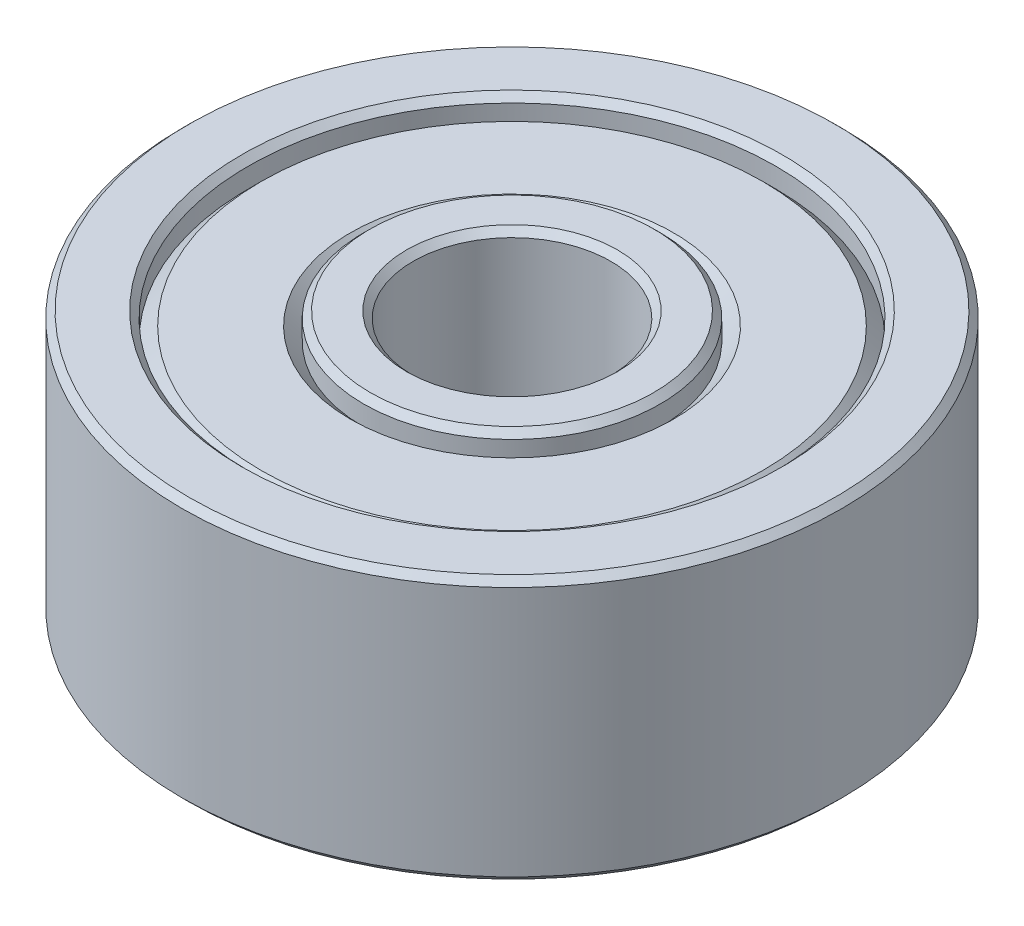
ISO-10303-21;
HEADER;
FILE_DESCRIPTION(('STEP AP214'),'2;1');
FILE_NAME('part.step','',(''),(''),'','','');
FILE_SCHEMA(('AUTOMOTIVE_DESIGN { 1 0 10303 214 1 1 1 1 }'));
ENDSEC;
DATA;
#1=APPLICATION_CONTEXT('core data for automotive mechanical design processes');
#2=APPLICATION_PROTOCOL_DEFINITION('international standard','automotive_design',2000,#1);
#3=PRODUCT_CONTEXT('',#1,'mechanical');
#4=PRODUCT('Part','Part','',(#3));
#5=PRODUCT_RELATED_PRODUCT_CATEGORY('part','',(#4));
#6=PRODUCT_DEFINITION_FORMATION('','',#4);
#7=PRODUCT_DEFINITION_CONTEXT('part definition',#1,'design');
#8=PRODUCT_DEFINITION('design','',#6,#7);
#9=PRODUCT_DEFINITION_SHAPE('','',#8);
#10=(LENGTH_UNIT() NAMED_UNIT(*) SI_UNIT(.MILLI.,.METRE.));
#11=(NAMED_UNIT(*) PLANE_ANGLE_UNIT() SI_UNIT($,.RADIAN.));
#12=(NAMED_UNIT(*) SI_UNIT($,.STERADIAN.) SOLID_ANGLE_UNIT());
#13=UNCERTAINTY_MEASURE_WITH_UNIT(LENGTH_MEASURE(1.E-05),#10,'distance_accuracy_value','');
#14=(GEOMETRIC_REPRESENTATION_CONTEXT(3) GLOBAL_UNCERTAINTY_ASSIGNED_CONTEXT((#13)) GLOBAL_UNIT_ASSIGNED_CONTEXT((#10,
#11,#12)) REPRESENTATION_CONTEXT('',''));
#15=CARTESIAN_POINT('',(0.,0.,0.));
#16=DIRECTION('',(0.,0.,1.));
#17=DIRECTION('',(1.,0.,0.));
#18=AXIS2_PLACEMENT_3D('',#15,#16,#17);
#19=CARTESIAN_POINT('',(0.,-2.,0.));
#20=DIRECTION('',(0.,1.,0.));
#21=DIRECTION('',(0.,0.,1.));
#22=AXIS2_PLACEMENT_3D('',#19,#20,#21);
#23=PLANE('',#22);
#24=CARTESIAN_POINT('',(0.,-2.,0.));
#25=DIRECTION('',(0.,1.,0.));
#26=DIRECTION('',(0.,0.,1.));
#27=AXIS2_PLACEMENT_3D('',#24,#25,#26);
#28=CIRCLE('',#27,4.10000000000001);
#29=CARTESIAN_POINT('',(0.,-2.,4.10000000000001));
#30=VERTEX_POINT('',#29);
#31=EDGE_CURVE('E62',#30,#30,#28,.T.);
#32=ORIENTED_EDGE('',*,*,#31,.T.);
#33=EDGE_LOOP('',(#32));
#34=FACE_BOUND('',#33,.T.);
#35=CARTESIAN_POINT('',(0.,-2.,0.));
#36=DIRECTION('',(0.,1.,0.));
#37=DIRECTION('',(0.,0.,1.));
#38=AXIS2_PLACEMENT_3D('',#35,#36,#37);
#39=CIRCLE('',#38,4.9);
#40=CARTESIAN_POINT('',(0.,-2.,4.9));
#41=VERTEX_POINT('',#40);
#42=EDGE_CURVE('E65',#41,#41,#39,.F.);
#43=ORIENTED_EDGE('',*,*,#42,.T.);
#44=EDGE_LOOP('',(#43));
#45=FACE_BOUND('',#44,.T.);
#46=ADVANCED_FACE('F36',(#34,#45),#23,.F.);
#47=CARTESIAN_POINT('',(0.,-2.,0.));
#48=DIRECTION('',(0.,1.,0.));
#49=DIRECTION('',(0.,0.,1.));
#50=AXIS2_PLACEMENT_3D('',#47,#48,#49);
#51=CIRCLE('',#50,1.6);
#52=CARTESIAN_POINT('',(0.,-2.,1.6));
#53=VERTEX_POINT('',#52);
#54=EDGE_CURVE('E86',#53,#53,#51,.T.);
#55=ORIENTED_EDGE('',*,*,#54,.T.);
#56=EDGE_LOOP('',(#55));
#57=FACE_BOUND('',#56,.T.);
#58=CARTESIAN_POINT('',(0.,-2.,0.));
#59=DIRECTION('',(0.,1.,0.));
#60=DIRECTION('',(0.,0.,1.));
#61=AXIS2_PLACEMENT_3D('',#58,#59,#60);
#62=CIRCLE('',#61,2.15);
#63=CARTESIAN_POINT('',(0.,-2.,2.15));
#64=VERTEX_POINT('',#63);
#65=EDGE_CURVE('E89',#64,#64,#62,.F.);
#66=ORIENTED_EDGE('',*,*,#65,.T.);
#67=EDGE_LOOP('',(#66));
#68=FACE_BOUND('',#67,.T.);
#69=ADVANCED_FACE('F143',(#57,#68),#23,.F.);
#70=CARTESIAN_POINT('',(0.,2.,0.));
#71=DIRECTION('',(0.,1.,0.));
#72=DIRECTION('',(0.,0.,1.));
#73=AXIS2_PLACEMENT_3D('',#70,#71,#72);
#74=PLANE('',#73);
#75=CARTESIAN_POINT('',(0.,2.,0.));
#76=DIRECTION('',(0.,1.,0.));
#77=DIRECTION('',(0.,0.,1.));
#78=AXIS2_PLACEMENT_3D('',#75,#76,#77);
#79=CIRCLE('',#78,4.1);
#80=CARTESIAN_POINT('',(0.,2.,4.1));
#81=VERTEX_POINT('',#80);
#82=EDGE_CURVE('E47',#81,#81,#79,.F.);
#83=ORIENTED_EDGE('',*,*,#82,.T.);
#84=EDGE_LOOP('',(#83));
#85=FACE_BOUND('',#84,.T.);
#86=CARTESIAN_POINT('',(0.,2.,0.));
#87=DIRECTION('',(0.,1.,0.));
#88=DIRECTION('',(0.,0.,1.));
#89=AXIS2_PLACEMENT_3D('',#86,#87,#88);
#90=CIRCLE('',#89,4.9);
#91=CARTESIAN_POINT('',(0.,2.,4.9));
#92=VERTEX_POINT('',#91);
#93=EDGE_CURVE('E51',#92,#92,#90,.T.);
#94=ORIENTED_EDGE('',*,*,#93,.T.);
#95=EDGE_LOOP('',(#94));
#96=FACE_BOUND('',#95,.T.);
#97=ADVANCED_FACE('F149',(#85,#96),#74,.T.);
#98=CARTESIAN_POINT('',(0.,2.,0.));
#99=DIRECTION('',(0.,1.,0.));
#100=DIRECTION('',(0.,0.,1.));
#101=AXIS2_PLACEMENT_3D('',#98,#99,#100);
#102=CIRCLE('',#101,1.6);
#103=CARTESIAN_POINT('',(0.,2.,1.6));
#104=VERTEX_POINT('',#103);
#105=EDGE_CURVE('E74',#104,#104,#102,.F.);
#106=ORIENTED_EDGE('',*,*,#105,.T.);
#107=EDGE_LOOP('',(#106));
#108=FACE_BOUND('',#107,.T.);
#109=CARTESIAN_POINT('',(0.,2.,0.));
#110=DIRECTION('',(0.,1.,0.));
#111=DIRECTION('',(0.,0.,1.));
#112=AXIS2_PLACEMENT_3D('',#109,#110,#111);
#113=CIRCLE('',#112,2.15);
#114=CARTESIAN_POINT('',(0.,2.,2.15));
#115=VERTEX_POINT('',#114);
#116=EDGE_CURVE('E77',#115,#115,#113,.T.);
#117=ORIENTED_EDGE('',*,*,#116,.T.);
#118=EDGE_LOOP('',(#117));
#119=FACE_BOUND('',#118,.T.);
#120=ADVANCED_FACE('F159',(#108,#119),#74,.T.);
#121=CARTESIAN_POINT('',(0.,2.,0.));
#122=DIRECTION('',(0.,1.,0.));
#123=DIRECTION('',(0.,0.,1.));
#124=AXIS2_PLACEMENT_3D('',#121,#122,#123);
#125=CYLINDRICAL_SURFACE('',#124,1.5);
#126=CARTESIAN_POINT('',(0.,-1.9,0.));
#127=DIRECTION('',(0.,1.,0.));
#128=DIRECTION('',(0.,0.,1.));
#129=AXIS2_PLACEMENT_3D('',#126,#127,#128);
#130=CIRCLE('',#129,1.5);
#131=CARTESIAN_POINT('',(0.,-1.9,1.5));
#132=VERTEX_POINT('',#131);
#133=EDGE_CURVE('E80',#132,#132,#130,.F.);
#134=ORIENTED_EDGE('',*,*,#133,.T.);
#135=EDGE_LOOP('',(#134));
#136=FACE_BOUND('',#135,.T.);
#137=CARTESIAN_POINT('',(0.,1.9,0.));
#138=DIRECTION('',(0.,1.,0.));
#139=DIRECTION('',(0.,0.,1.));
#140=AXIS2_PLACEMENT_3D('',#137,#138,#139);
#141=CIRCLE('',#140,1.5);
#142=CARTESIAN_POINT('',(0.,1.9,1.5));
#143=VERTEX_POINT('',#142);
#144=EDGE_CURVE('E83',#143,#143,#141,.T.);
#145=ORIENTED_EDGE('',*,*,#144,.T.);
#146=EDGE_LOOP('',(#145));
#147=FACE_BOUND('',#146,.T.);
#148=ADVANCED_FACE('F156',(#136,#147),#125,.F.);
#149=CARTESIAN_POINT('',(0.,2.,0.));
#150=DIRECTION('',(0.,1.,0.));
#151=DIRECTION('',(0.,0.,1.));
#152=AXIS2_PLACEMENT_3D('',#149,#150,#151);
#153=CYLINDRICAL_SURFACE('',#152,5.);
#154=CARTESIAN_POINT('',(0.,-1.9,0.));
#155=DIRECTION('',(0.,1.,0.));
#156=DIRECTION('',(0.,0.,1.));
#157=AXIS2_PLACEMENT_3D('',#154,#155,#156);
#158=CIRCLE('',#157,5.);
#159=CARTESIAN_POINT('',(0.,-1.9,5.));
#160=VERTEX_POINT('',#159);
#161=EDGE_CURVE('E10',#160,#160,#158,.T.);
#162=ORIENTED_EDGE('',*,*,#161,.T.);
#163=EDGE_LOOP('',(#162));
#164=FACE_BOUND('',#163,.T.);
#165=CARTESIAN_POINT('',(0.,1.9,0.));
#166=DIRECTION('',(0.,1.,0.));
#167=DIRECTION('',(0.,0.,1.));
#168=AXIS2_PLACEMENT_3D('',#165,#166,#167);
#169=CIRCLE('',#168,5.);
#170=CARTESIAN_POINT('',(0.,1.9,5.));
#171=VERTEX_POINT('',#170);
#172=EDGE_CURVE('E43',#171,#171,#169,.F.);
#173=ORIENTED_EDGE('',*,*,#172,.T.);
#174=EDGE_LOOP('',(#173));
#175=FACE_BOUND('',#174,.T.);
#176=ADVANCED_FACE('F154',(#164,#175),#153,.T.);
#177=CARTESIAN_POINT('',(0.,1.8,0.));
#178=DIRECTION('',(0.,-1.,0.));
#179=DIRECTION('',(0.,0.,-1.));
#180=AXIS2_PLACEMENT_3D('',#177,#178,#179);
#181=CONICAL_SURFACE('',#180,3.8,0.785398163397448);
#182=CARTESIAN_POINT('',(0.,1.6,0.));
#183=DIRECTION('',(0.,1.,0.));
#184=DIRECTION('',(0.,0.,1.));
#185=AXIS2_PLACEMENT_3D('',#182,#183,#184);
#186=CIRCLE('',#185,4.);
#187=CARTESIAN_POINT('',(0.,1.6,4.));
#188=VERTEX_POINT('',#187);
#189=EDGE_CURVE('E92',#188,#188,#186,.T.);
#190=ORIENTED_EDGE('',*,*,#189,.T.);
#191=EDGE_LOOP('',(#190));
#192=FACE_BOUND('',#191,.T.);
#193=CARTESIAN_POINT('',(0.,1.8,0.));
#194=DIRECTION('',(0.,1.,0.));
#195=DIRECTION('',(0.,0.,1.));
#196=AXIS2_PLACEMENT_3D('',#193,#194,#195);
#197=CIRCLE('',#196,3.8);
#198=CARTESIAN_POINT('',(0.,1.8,3.8));
#199=VERTEX_POINT('',#198);
#200=EDGE_CURVE('E101',#199,#199,#197,.T.);
#201=ORIENTED_EDGE('',*,*,#200,.F.);
#202=EDGE_LOOP('',(#201));
#203=FACE_BOUND('',#202,.T.);
#204=ADVANCED_FACE('F277',(#192,#203),#181,.T.);
#205=CARTESIAN_POINT('',(0.,2.,0.));
#206=DIRECTION('',(0.,1.,0.));
#207=DIRECTION('',(0.,0.,1.));
#208=AXIS2_PLACEMENT_3D('',#205,#206,#207);
#209=CYLINDRICAL_SURFACE('',#208,4.);
#210=CARTESIAN_POINT('',(0.,1.9,0.));
#211=DIRECTION('',(0.,1.,0.));
#212=DIRECTION('',(0.,0.,1.));
#213=AXIS2_PLACEMENT_3D('',#210,#211,#212);
#214=CIRCLE('',#213,4.);
#215=CARTESIAN_POINT('',(0.,1.9,4.));
#216=VERTEX_POINT('',#215);
#217=EDGE_CURVE('E56',#216,#216,#214,.T.);
#218=ORIENTED_EDGE('',*,*,#217,.T.);
#219=EDGE_LOOP('',(#218));
#220=FACE_BOUND('',#219,.T.);
#221=ORIENTED_EDGE('',*,*,#189,.F.);
#222=EDGE_LOOP('',(#221));
#223=FACE_BOUND('',#222,.T.);
#224=ADVANCED_FACE('F265',(#220,#223),#209,.F.);
#225=CARTESIAN_POINT('',(0.,2.,0.));
#226=DIRECTION('',(0.,1.,0.));
#227=DIRECTION('',(0.,0.,1.));
#228=AXIS2_PLACEMENT_3D('',#225,#226,#227);
#229=CYLINDRICAL_SURFACE('',#228,2.25);
#230=CARTESIAN_POINT('',(0.,1.9,0.));
#231=DIRECTION('',(0.,1.,0.));
#232=DIRECTION('',(0.,0.,1.));
#233=AXIS2_PLACEMENT_3D('',#230,#231,#232);
#234=CIRCLE('',#233,2.25);
#235=CARTESIAN_POINT('',(0.,1.9,2.25));
#236=VERTEX_POINT('',#235);
#237=EDGE_CURVE('E68',#236,#236,#234,.F.);
#238=ORIENTED_EDGE('',*,*,#237,.T.);
#239=EDGE_LOOP('',(#238));
#240=FACE_BOUND('',#239,.T.);
#241=CARTESIAN_POINT('',(0.,1.6,0.));
#242=DIRECTION('',(0.,1.,0.));
#243=DIRECTION('',(0.,0.,1.));
#244=AXIS2_PLACEMENT_3D('',#241,#242,#243);
#245=CIRCLE('',#244,2.25);
#246=CARTESIAN_POINT('',(0.,1.6,2.25));
#247=VERTEX_POINT('',#246);
#248=EDGE_CURVE('E95',#247,#247,#245,.T.);
#249=ORIENTED_EDGE('',*,*,#248,.T.);
#250=EDGE_LOOP('',(#249));
#251=FACE_BOUND('',#250,.T.);
#252=ADVANCED_FACE('F259',(#240,#251),#229,.T.);
#253=CARTESIAN_POINT('',(0.,1.6,0.));
#254=DIRECTION('',(0.,1.,0.));
#255=DIRECTION('',(0.,0.,1.));
#256=AXIS2_PLACEMENT_3D('',#253,#254,#255);
#257=CONICAL_SURFACE('',#256,2.25,0.785398163397449);
#258=CARTESIAN_POINT('',(0.,1.8,0.));
#259=DIRECTION('',(0.,1.,0.));
#260=DIRECTION('',(0.,0.,1.));
#261=AXIS2_PLACEMENT_3D('',#258,#259,#260);
#262=CIRCLE('',#261,2.45);
#263=CARTESIAN_POINT('',(0.,1.8,2.45));
#264=VERTEX_POINT('',#263);
#265=EDGE_CURVE('E98',#264,#264,#262,.T.);
#266=ORIENTED_EDGE('',*,*,#265,.T.);
#267=EDGE_LOOP('',(#266));
#268=FACE_BOUND('',#267,.T.);
#269=ORIENTED_EDGE('',*,*,#248,.F.);
#270=EDGE_LOOP('',(#269));
#271=FACE_BOUND('',#270,.T.);
#272=ADVANCED_FACE('F264',(#268,#271),#257,.F.);
#273=CARTESIAN_POINT('',(0.,1.8,0.));
#274=DIRECTION('',(0.,1.,0.));
#275=DIRECTION('',(0.,0.,1.));
#276=AXIS2_PLACEMENT_3D('',#273,#274,#275);
#277=PLANE('',#276);
#278=ORIENTED_EDGE('',*,*,#200,.T.);
#279=EDGE_LOOP('',(#278));
#280=FACE_BOUND('',#279,.T.);
#281=ORIENTED_EDGE('',*,*,#265,.F.);
#282=EDGE_LOOP('',(#281));
#283=FACE_BOUND('',#282,.T.);
#284=ADVANCED_FACE('F340',(#280,#283),#277,.T.);
#285=CARTESIAN_POINT('',(0.,-1.8,0.));
#286=DIRECTION('',(0.,1.,0.));
#287=DIRECTION('',(0.,0.,-1.));
#288=AXIS2_PLACEMENT_3D('',#285,#286,#287);
#289=CONICAL_SURFACE('',#288,3.8,0.785398163397448);
#290=CARTESIAN_POINT('',(0.,-1.6,0.));
#291=DIRECTION('',(0.,1.,0.));
#292=DIRECTION('',(0.,0.,1.));
#293=AXIS2_PLACEMENT_3D('',#290,#291,#292);
#294=CIRCLE('',#293,4.);
#295=CARTESIAN_POINT('',(0.,-1.6,4.));
#296=VERTEX_POINT('',#295);
#297=EDGE_CURVE('E104',#296,#296,#294,.T.);
#298=ORIENTED_EDGE('',*,*,#297,.F.);
#299=EDGE_LOOP('',(#298));
#300=FACE_BOUND('',#299,.T.);
#301=CARTESIAN_POINT('',(0.,-1.8,0.));
#302=DIRECTION('',(0.,1.,0.));
#303=DIRECTION('',(0.,0.,1.));
#304=AXIS2_PLACEMENT_3D('',#301,#302,#303);
#305=CIRCLE('',#304,3.8);
#306=CARTESIAN_POINT('',(0.,-1.8,3.8));
#307=VERTEX_POINT('',#306);
#308=EDGE_CURVE('E113',#307,#307,#305,.T.);
#309=ORIENTED_EDGE('',*,*,#308,.T.);
#310=EDGE_LOOP('',(#309));
#311=FACE_BOUND('',#310,.T.);
#312=ADVANCED_FACE('F117',(#300,#311),#289,.T.);
#313=CARTESIAN_POINT('',(0.,-2.,0.));
#314=DIRECTION('',(0.,-1.,0.));
#315=DIRECTION('',(0.,0.,1.));
#316=AXIS2_PLACEMENT_3D('',#313,#314,#315);
#317=CYLINDRICAL_SURFACE('',#316,4.);
#318=CARTESIAN_POINT('',(0.,-1.9,0.));
#319=DIRECTION('',(0.,1.,0.));
#320=DIRECTION('',(0.,0.,1.));
#321=AXIS2_PLACEMENT_3D('',#318,#319,#320);
#322=CIRCLE('',#321,4.);
#323=CARTESIAN_POINT('',(0.,-1.9,4.));
#324=VERTEX_POINT('',#323);
#325=EDGE_CURVE('E59',#324,#324,#322,.F.);
#326=ORIENTED_EDGE('',*,*,#325,.T.);
#327=EDGE_LOOP('',(#326));
#328=FACE_BOUND('',#327,.T.);
#329=ORIENTED_EDGE('',*,*,#297,.T.);
#330=EDGE_LOOP('',(#329));
#331=FACE_BOUND('',#330,.T.);
#332=ADVANCED_FACE('F134',(#328,#331),#317,.F.);
#333=CARTESIAN_POINT('',(0.,-2.,0.));
#334=DIRECTION('',(0.,-1.,0.));
#335=DIRECTION('',(0.,0.,1.));
#336=AXIS2_PLACEMENT_3D('',#333,#334,#335);
#337=CYLINDRICAL_SURFACE('',#336,2.25);
#338=CARTESIAN_POINT('',(0.,-1.9,0.));
#339=DIRECTION('',(0.,1.,0.));
#340=DIRECTION('',(0.,0.,1.));
#341=AXIS2_PLACEMENT_3D('',#338,#339,#340);
#342=CIRCLE('',#341,2.25);
#343=CARTESIAN_POINT('',(0.,-1.9,2.25));
#344=VERTEX_POINT('',#343);
#345=EDGE_CURVE('E71',#344,#344,#342,.T.);
#346=ORIENTED_EDGE('',*,*,#345,.T.);
#347=EDGE_LOOP('',(#346));
#348=FACE_BOUND('',#347,.T.);
#349=CARTESIAN_POINT('',(0.,-1.6,0.));
#350=DIRECTION('',(0.,1.,0.));
#351=DIRECTION('',(0.,0.,1.));
#352=AXIS2_PLACEMENT_3D('',#349,#350,#351);
#353=CIRCLE('',#352,2.25);
#354=CARTESIAN_POINT('',(0.,-1.6,2.25));
#355=VERTEX_POINT('',#354);
#356=EDGE_CURVE('E107',#355,#355,#353,.T.);
#357=ORIENTED_EDGE('',*,*,#356,.F.);
#358=EDGE_LOOP('',(#357));
#359=FACE_BOUND('',#358,.T.);
#360=ADVANCED_FACE('F129',(#348,#359),#337,.T.);
#361=CARTESIAN_POINT('',(0.,-1.6,0.));
#362=DIRECTION('',(0.,-1.,0.));
#363=DIRECTION('',(0.,0.,1.));
#364=AXIS2_PLACEMENT_3D('',#361,#362,#363);
#365=CONICAL_SURFACE('',#364,2.25,0.785398163397449);
#366=CARTESIAN_POINT('',(0.,-1.8,0.));
#367=DIRECTION('',(0.,1.,0.));
#368=DIRECTION('',(0.,0.,1.));
#369=AXIS2_PLACEMENT_3D('',#366,#367,#368);
#370=CIRCLE('',#369,2.45);
#371=CARTESIAN_POINT('',(0.,-1.8,2.45));
#372=VERTEX_POINT('',#371);
#373=EDGE_CURVE('E110',#372,#372,#370,.T.);
#374=ORIENTED_EDGE('',*,*,#373,.F.);
#375=EDGE_LOOP('',(#374));
#376=FACE_BOUND('',#375,.T.);
#377=ORIENTED_EDGE('',*,*,#356,.T.);
#378=EDGE_LOOP('',(#377));
#379=FACE_BOUND('',#378,.T.);
#380=ADVANCED_FACE('F123',(#376,#379),#365,.F.);
#381=CARTESIAN_POINT('',(0.,-1.8,0.));
#382=DIRECTION('',(0.,-1.,0.));
#383=DIRECTION('',(0.,0.,1.));
#384=AXIS2_PLACEMENT_3D('',#381,#382,#383);
#385=PLANE('',#384);
#386=ORIENTED_EDGE('',*,*,#308,.F.);
#387=EDGE_LOOP('',(#386));
#388=FACE_BOUND('',#387,.T.);
#389=ORIENTED_EDGE('',*,*,#373,.T.);
#390=EDGE_LOOP('',(#389));
#391=FACE_BOUND('',#390,.T.);
#392=ADVANCED_FACE('F119',(#388,#391),#385,.T.);
#393=CARTESIAN_POINT('',(0.,-2.,0.));
#394=DIRECTION('',(0.,-1.,0.));
#395=DIRECTION('',(0.,0.,-1.));
#396=AXIS2_PLACEMENT_3D('',#393,#394,#395);
#397=CONICAL_SURFACE('',#396,1.6,0.785398163397454);
#398=ORIENTED_EDGE('',*,*,#133,.F.);
#399=EDGE_LOOP('',(#398));
#400=FACE_BOUND('',#399,.T.);
#401=ORIENTED_EDGE('',*,*,#54,.F.);
#402=EDGE_LOOP('',(#401));
#403=FACE_BOUND('',#402,.T.);
#404=ADVANCED_FACE('F122',(#400,#403),#397,.F.);
#405=CARTESIAN_POINT('',(0.,1.9,0.));
#406=DIRECTION('',(0.,1.,0.));
#407=DIRECTION('',(0.,0.,1.));
#408=AXIS2_PLACEMENT_3D('',#405,#406,#407);
#409=CONICAL_SURFACE('',#408,1.5,0.78539816339745);
#410=ORIENTED_EDGE('',*,*,#105,.F.);
#411=EDGE_LOOP('',(#410));
#412=FACE_BOUND('',#411,.T.);
#413=ORIENTED_EDGE('',*,*,#144,.F.);
#414=EDGE_LOOP('',(#413));
#415=FACE_BOUND('',#414,.T.);
#416=ADVANCED_FACE('F166',(#412,#415),#409,.F.);
#417=CARTESIAN_POINT('',(0.,-1.9,0.));
#418=DIRECTION('',(0.,1.,0.));
#419=DIRECTION('',(0.,0.,1.));
#420=AXIS2_PLACEMENT_3D('',#417,#418,#419);
#421=CONICAL_SURFACE('',#420,2.25,0.785398163397446);
#422=ORIENTED_EDGE('',*,*,#65,.F.);
#423=EDGE_LOOP('',(#422));
#424=FACE_BOUND('',#423,.T.);
#425=ORIENTED_EDGE('',*,*,#345,.F.);
#426=EDGE_LOOP('',(#425));
#427=FACE_BOUND('',#426,.T.);
#428=ADVANCED_FACE('F170',(#424,#427),#421,.T.);
#429=CARTESIAN_POINT('',(0.,2.,0.));
#430=DIRECTION('',(0.,-1.,0.));
#431=DIRECTION('',(0.,0.,-1.));
#432=AXIS2_PLACEMENT_3D('',#429,#430,#431);
#433=CONICAL_SURFACE('',#432,2.15,0.78539816339745);
#434=ORIENTED_EDGE('',*,*,#237,.F.);
#435=EDGE_LOOP('',(#434));
#436=FACE_BOUND('',#435,.T.);
#437=ORIENTED_EDGE('',*,*,#116,.F.);
#438=EDGE_LOOP('',(#437));
#439=FACE_BOUND('',#438,.T.);
#440=ADVANCED_FACE('F174',(#436,#439),#433,.T.);
#441=CARTESIAN_POINT('',(0.,-2.,0.));
#442=DIRECTION('',(0.,-1.,0.));
#443=DIRECTION('',(0.,0.,-1.));
#444=AXIS2_PLACEMENT_3D('',#441,#442,#443);
#445=CONICAL_SURFACE('',#444,4.1,0.785398163397453);
#446=ORIENTED_EDGE('',*,*,#325,.F.);
#447=EDGE_LOOP('',(#446));
#448=FACE_BOUND('',#447,.T.);
#449=ORIENTED_EDGE('',*,*,#31,.F.);
#450=EDGE_LOOP('',(#449));
#451=FACE_BOUND('',#450,.T.);
#452=ADVANCED_FACE('F178',(#448,#451),#445,.F.);
#453=CARTESIAN_POINT('',(0.,1.9,0.));
#454=DIRECTION('',(0.,1.,0.));
#455=DIRECTION('',(0.,0.,1.));
#456=AXIS2_PLACEMENT_3D('',#453,#454,#455);
#457=CONICAL_SURFACE('',#456,4.,0.785398163397453);
#458=ORIENTED_EDGE('',*,*,#82,.F.);
#459=EDGE_LOOP('',(#458));
#460=FACE_BOUND('',#459,.T.);
#461=ORIENTED_EDGE('',*,*,#217,.F.);
#462=EDGE_LOOP('',(#461));
#463=FACE_BOUND('',#462,.T.);
#464=ADVANCED_FACE('F182',(#460,#463),#457,.F.);
#465=CARTESIAN_POINT('',(0.,-1.9,0.));
#466=DIRECTION('',(0.,1.,0.));
#467=DIRECTION('',(0.,0.,1.));
#468=AXIS2_PLACEMENT_3D('',#465,#466,#467);
#469=CONICAL_SURFACE('',#468,5.,0.785398163397457);
#470=ORIENTED_EDGE('',*,*,#42,.F.);
#471=EDGE_LOOP('',(#470));
#472=FACE_BOUND('',#471,.T.);
#473=ORIENTED_EDGE('',*,*,#161,.F.);
#474=EDGE_LOOP('',(#473));
#475=FACE_BOUND('',#474,.T.);
#476=ADVANCED_FACE('F185',(#472,#475),#469,.T.);
#477=CARTESIAN_POINT('',(0.,2.,0.));
#478=DIRECTION('',(0.,-1.,0.));
#479=DIRECTION('',(0.,0.,-1.));
#480=AXIS2_PLACEMENT_3D('',#477,#478,#479);
#481=CONICAL_SURFACE('',#480,4.9,0.785398163397448);
#482=ORIENTED_EDGE('',*,*,#172,.F.);
#483=EDGE_LOOP('',(#482));
#484=FACE_BOUND('',#483,.T.);
#485=ORIENTED_EDGE('',*,*,#93,.F.);
#486=EDGE_LOOP('',(#485));
#487=FACE_BOUND('',#486,.T.);
#488=ADVANCED_FACE('F38',(#484,#487),#481,.T.);
#489=CLOSED_SHELL('',(#46,#69,#97,#120,#148,#176,#204,#224,#252,#272,#284,#312,#332,#360,#380,
#392,#404,#416,#428,#440,#452,#464,#476,#488));
#490=MANIFOLD_SOLID_BREP('B2',#489);
#491=ADVANCED_BREP_SHAPE_REPRESENTATION('',(#18,#490),#14);
#492=SHAPE_DEFINITION_REPRESENTATION(#9,#491);
ENDSEC;
END-ISO-10303-21;
